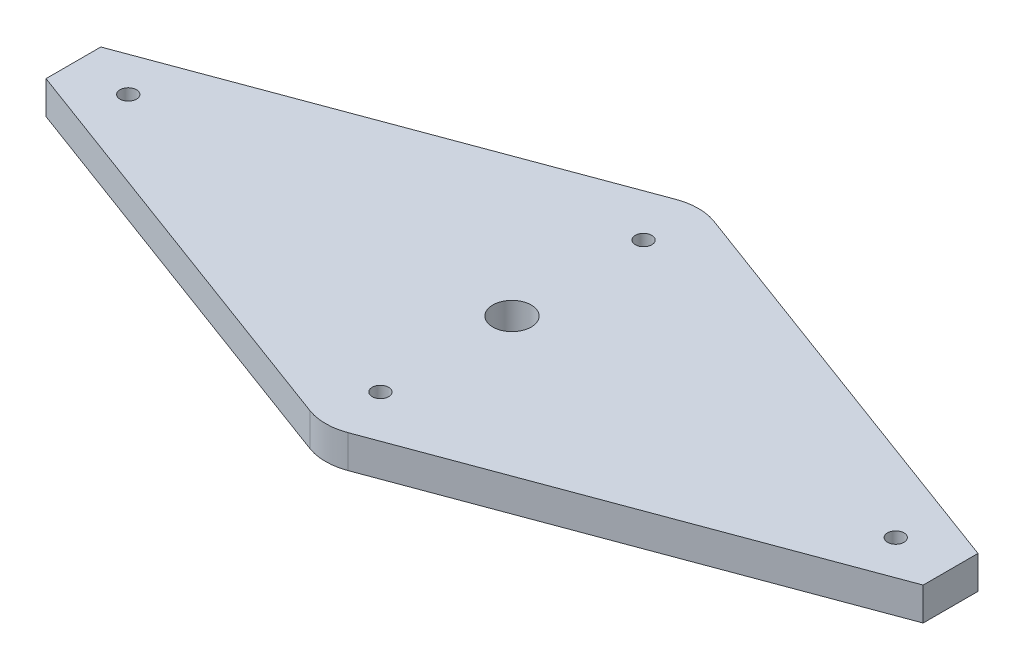
ISO-10303-21;
HEADER;
FILE_DESCRIPTION(('STEP AP214'),'2;1');
FILE_NAME('part.step','',(''),(''),'','','');
FILE_SCHEMA(('AUTOMOTIVE_DESIGN { 1 0 10303 214 1 1 1 1 }'));
ENDSEC;
DATA;
#1=APPLICATION_CONTEXT('core data for automotive mechanical design processes');
#2=APPLICATION_PROTOCOL_DEFINITION('international standard','automotive_design',2000,#1);
#3=PRODUCT_CONTEXT('',#1,'mechanical');
#4=PRODUCT('Part','Part','',(#3));
#5=PRODUCT_RELATED_PRODUCT_CATEGORY('part','',(#4));
#6=PRODUCT_DEFINITION_FORMATION('','',#4);
#7=PRODUCT_DEFINITION_CONTEXT('part definition',#1,'design');
#8=PRODUCT_DEFINITION('design','',#6,#7);
#9=PRODUCT_DEFINITION_SHAPE('','',#8);
#10=(LENGTH_UNIT() NAMED_UNIT(*) SI_UNIT(.MILLI.,.METRE.));
#11=(NAMED_UNIT(*) PLANE_ANGLE_UNIT() SI_UNIT($,.RADIAN.));
#12=(NAMED_UNIT(*) SI_UNIT($,.STERADIAN.) SOLID_ANGLE_UNIT());
#13=UNCERTAINTY_MEASURE_WITH_UNIT(LENGTH_MEASURE(1.E-05),#10,'distance_accuracy_value','');
#14=(GEOMETRIC_REPRESENTATION_CONTEXT(3) GLOBAL_UNCERTAINTY_ASSIGNED_CONTEXT((#13)) GLOBAL_UNIT_ASSIGNED_CONTEXT((#10,
#11,#12)) REPRESENTATION_CONTEXT('',''));
#15=CARTESIAN_POINT('',(0.,0.,0.));
#16=DIRECTION('',(0.,0.,1.));
#17=DIRECTION('',(1.,0.,0.));
#18=AXIS2_PLACEMENT_3D('',#15,#16,#17);
#19=CARTESIAN_POINT('',(0.,1.5,-12.));
#20=DIRECTION('',(0.,1.,0.));
#21=DIRECTION('',(0.,0.,1.));
#22=AXIS2_PLACEMENT_3D('',#19,#20,#21);
#23=PLANE('',#22);
#24=CARTESIAN_POINT('',(-35.,1.5,0.));
#25=DIRECTION('',(0.,1.,0.));
#26=DIRECTION('',(0.,0.,1.));
#27=AXIS2_PLACEMENT_3D('',#24,#25,#26);
#28=CIRCLE('',#27,0.749999999999999);
#29=CARTESIAN_POINT('',(-35.,1.5,0.749999999999999));
#30=VERTEX_POINT('',#29);
#31=EDGE_CURVE('E237',#30,#30,#28,.T.);
#32=ORIENTED_EDGE('',*,*,#31,.F.);
#33=EDGE_LOOP('',(#32));
#34=FACE_BOUND('',#33,.T.);
#35=CARTESIAN_POINT('',(0.,1.5,12.));
#36=DIRECTION('',(0.,1.,0.));
#37=DIRECTION('',(0.,0.,1.));
#38=AXIS2_PLACEMENT_3D('',#35,#36,#37);
#39=CIRCLE('',#38,0.750000000000001);
#40=CARTESIAN_POINT('',(0.,1.5,12.75));
#41=VERTEX_POINT('',#40);
#42=EDGE_CURVE('E249',#41,#41,#39,.T.);
#43=ORIENTED_EDGE('',*,*,#42,.F.);
#44=EDGE_LOOP('',(#43));
#45=FACE_BOUND('',#44,.T.);
#46=CARTESIAN_POINT('',(0.,1.5,-12.));
#47=DIRECTION('',(0.,1.,0.));
#48=DIRECTION('',(0.,0.,1.));
#49=AXIS2_PLACEMENT_3D('',#46,#47,#48);
#50=CIRCLE('',#49,5.);
#51=CARTESIAN_POINT('',(1.73841446724475,1.5,-16.6880609147146));
#52=VERTEX_POINT('',#51);
#53=CARTESIAN_POINT('',(-1.73841446724467,1.5,-16.6880609147146));
#54=VERTEX_POINT('',#53);
#55=EDGE_CURVE('E133',#52,#54,#50,.T.);
#56=ORIENTED_EDGE('',*,*,#55,.T.);
#57=DIRECTION('',(-0.937612182942912,0.,0.347682893448941));
#58=VECTOR('',#57,1.);
#59=CARTESIAN_POINT('',(-1.73841446724467,1.5,-16.6880609147146));
#60=LINE('',#59,#58);
#61=CARTESIAN_POINT('',(-40.,1.5,-2.50000000000001));
#62=VERTEX_POINT('',#61);
#63=EDGE_CURVE('E110',#54,#62,#60,.T.);
#64=ORIENTED_EDGE('',*,*,#63,.T.);
#65=DIRECTION('',(0.,0.,1.));
#66=VECTOR('',#65,1.);
#67=CARTESIAN_POINT('',(-40.,1.5,-2.50000000000001));
#68=LINE('',#67,#66);
#69=CARTESIAN_POINT('',(-40.,1.5,2.49999999999999));
#70=VERTEX_POINT('',#69);
#71=EDGE_CURVE('E136',#62,#70,#68,.T.);
#72=ORIENTED_EDGE('',*,*,#71,.T.);
#73=DIRECTION('',(0.937612182942911,0.,0.347682893448942));
#74=VECTOR('',#73,1.);
#75=CARTESIAN_POINT('',(-40.,1.5,2.49999999999999));
#76=LINE('',#75,#74);
#77=CARTESIAN_POINT('',(-1.73841446724474,1.5,16.6880609147146));
#78=VERTEX_POINT('',#77);
#79=EDGE_CURVE('E138',#70,#78,#76,.T.);
#80=ORIENTED_EDGE('',*,*,#79,.T.);
#81=CARTESIAN_POINT('',(0.,1.5,12.));
#82=DIRECTION('',(0.,1.,0.));
#83=DIRECTION('',(0.,0.,1.));
#84=AXIS2_PLACEMENT_3D('',#81,#82,#83);
#85=CIRCLE('',#84,5.);
#86=CARTESIAN_POINT('',(1.73841446724467,1.5,16.6880609147146));
#87=VERTEX_POINT('',#86);
#88=EDGE_CURVE('E140',#78,#87,#85,.T.);
#89=ORIENTED_EDGE('',*,*,#88,.T.);
#90=DIRECTION('',(0.937612182942912,0.,-0.347682893448941));
#91=VECTOR('',#90,1.);
#92=CARTESIAN_POINT('',(1.73841446724467,1.5,16.6880609147146));
#93=LINE('',#92,#91);
#94=CARTESIAN_POINT('',(40.,1.5,2.50000000000001));
#95=VERTEX_POINT('',#94);
#96=EDGE_CURVE('E142',#87,#95,#93,.T.);
#97=ORIENTED_EDGE('',*,*,#96,.T.);
#98=DIRECTION('',(0.,0.,-1.));
#99=VECTOR('',#98,1.);
#100=CARTESIAN_POINT('',(40.,1.5,2.50000000000001));
#101=LINE('',#100,#99);
#102=CARTESIAN_POINT('',(40.,1.5,-2.49999999999999));
#103=VERTEX_POINT('',#102);
#104=EDGE_CURVE('E51',#95,#103,#101,.T.);
#105=ORIENTED_EDGE('',*,*,#104,.T.);
#106=DIRECTION('',(-0.937612182942911,0.,-0.347682893448942));
#107=VECTOR('',#106,1.);
#108=CARTESIAN_POINT('',(40.,1.5,-2.49999999999999));
#109=LINE('',#108,#107);
#110=EDGE_CURVE('E46',#103,#52,#109,.T.);
#111=ORIENTED_EDGE('',*,*,#110,.T.);
#112=EDGE_LOOP('',(#56,#64,#72,#80,#89,#97,#105,#111));
#113=FACE_BOUND('',#112,.T.);
#114=CARTESIAN_POINT('',(0.,1.5,-12.));
#115=DIRECTION('',(0.,1.,0.));
#116=DIRECTION('',(0.,0.,1.));
#117=AXIS2_PLACEMENT_3D('',#114,#115,#116);
#118=CIRCLE('',#117,0.750000000000001);
#119=CARTESIAN_POINT('',(0.,1.5,-11.25));
#120=VERTEX_POINT('',#119);
#121=EDGE_CURVE('E115',#120,#120,#118,.T.);
#122=ORIENTED_EDGE('',*,*,#121,.F.);
#123=EDGE_LOOP('',(#122));
#124=FACE_BOUND('',#123,.T.);
#125=CARTESIAN_POINT('',(35.,1.5,0.));
#126=DIRECTION('',(0.,1.,0.));
#127=DIRECTION('',(0.,0.,1.));
#128=AXIS2_PLACEMENT_3D('',#125,#126,#127);
#129=CIRCLE('',#128,0.749999999999999);
#130=CARTESIAN_POINT('',(35.,1.5,0.749999999999999));
#131=VERTEX_POINT('',#130);
#132=EDGE_CURVE('E243',#131,#131,#129,.T.);
#133=ORIENTED_EDGE('',*,*,#132,.F.);
#134=EDGE_LOOP('',(#133));
#135=FACE_BOUND('',#134,.T.);
#136=CARTESIAN_POINT('',(0.,1.5,0.));
#137=DIRECTION('',(0.,1.,0.));
#138=DIRECTION('',(0.,0.,1.));
#139=AXIS2_PLACEMENT_3D('',#136,#137,#138);
#140=CIRCLE('',#139,1.75);
#141=CARTESIAN_POINT('',(0.,1.5,1.75));
#142=VERTEX_POINT('',#141);
#143=EDGE_CURVE('E226',#142,#142,#140,.T.);
#144=ORIENTED_EDGE('',*,*,#143,.F.);
#145=EDGE_LOOP('',(#144));
#146=FACE_BOUND('',#145,.T.);
#147=ADVANCED_FACE('F31',(#34,#45,#113,#124,#135,#146),#23,.T.);
#148=CARTESIAN_POINT('',(0.,-1.5,-12.));
#149=DIRECTION('',(0.,1.,0.));
#150=DIRECTION('',(0.,0.,1.));
#151=AXIS2_PLACEMENT_3D('',#148,#149,#150);
#152=PLANE('',#151);
#153=CARTESIAN_POINT('',(-35.,-1.5,0.));
#154=DIRECTION('',(0.,1.,0.));
#155=DIRECTION('',(0.,0.,1.));
#156=AXIS2_PLACEMENT_3D('',#153,#154,#155);
#157=CIRCLE('',#156,0.749999999999999);
#158=CARTESIAN_POINT('',(-35.,-1.5,0.749999999999999));
#159=VERTEX_POINT('',#158);
#160=EDGE_CURVE('E232',#159,#159,#157,.T.);
#161=ORIENTED_EDGE('',*,*,#160,.T.);
#162=EDGE_LOOP('',(#161));
#163=FACE_BOUND('',#162,.T.);
#164=CARTESIAN_POINT('',(0.,-1.5,12.));
#165=DIRECTION('',(0.,1.,0.));
#166=DIRECTION('',(0.,0.,1.));
#167=AXIS2_PLACEMENT_3D('',#164,#165,#166);
#168=CIRCLE('',#167,0.750000000000001);
#169=CARTESIAN_POINT('',(0.,-1.5,12.75));
#170=VERTEX_POINT('',#169);
#171=EDGE_CURVE('E246',#170,#170,#168,.T.);
#172=ORIENTED_EDGE('',*,*,#171,.T.);
#173=EDGE_LOOP('',(#172));
#174=FACE_BOUND('',#173,.T.);
#175=CARTESIAN_POINT('',(0.,-1.5,-12.));
#176=DIRECTION('',(0.,1.,0.));
#177=DIRECTION('',(0.,0.,1.));
#178=AXIS2_PLACEMENT_3D('',#175,#176,#177);
#179=CIRCLE('',#178,5.);
#180=CARTESIAN_POINT('',(1.73841446724475,-1.5,-16.6880609147146));
#181=VERTEX_POINT('',#180);
#182=CARTESIAN_POINT('',(-1.73841446724467,-1.5,-16.6880609147146));
#183=VERTEX_POINT('',#182);
#184=EDGE_CURVE('E101',#181,#183,#179,.T.);
#185=ORIENTED_EDGE('',*,*,#184,.F.);
#186=DIRECTION('',(-0.937612182942911,0.,-0.347682893448942));
#187=VECTOR('',#186,1.);
#188=CARTESIAN_POINT('',(40.,-1.5,-2.49999999999999));
#189=LINE('',#188,#187);
#190=CARTESIAN_POINT('',(40.,-1.5,-2.49999999999999));
#191=VERTEX_POINT('',#190);
#192=EDGE_CURVE('E131',#191,#181,#189,.T.);
#193=ORIENTED_EDGE('',*,*,#192,.F.);
#194=DIRECTION('',(0.,0.,-1.));
#195=VECTOR('',#194,1.);
#196=CARTESIAN_POINT('',(40.,-1.5,2.50000000000001));
#197=LINE('',#196,#195);
#198=CARTESIAN_POINT('',(40.,-1.5,2.50000000000001));
#199=VERTEX_POINT('',#198);
#200=EDGE_CURVE('E129',#199,#191,#197,.T.);
#201=ORIENTED_EDGE('',*,*,#200,.F.);
#202=DIRECTION('',(0.937612182942912,0.,-0.347682893448941));
#203=VECTOR('',#202,1.);
#204=CARTESIAN_POINT('',(1.73841446724467,-1.5,16.6880609147146));
#205=LINE('',#204,#203);
#206=CARTESIAN_POINT('',(1.73841446724467,-1.5,16.6880609147146));
#207=VERTEX_POINT('',#206);
#208=EDGE_CURVE('E127',#207,#199,#205,.T.);
#209=ORIENTED_EDGE('',*,*,#208,.F.);
#210=CARTESIAN_POINT('',(0.,-1.5,12.));
#211=DIRECTION('',(0.,1.,0.));
#212=DIRECTION('',(0.,0.,1.));
#213=AXIS2_PLACEMENT_3D('',#210,#211,#212);
#214=CIRCLE('',#213,5.);
#215=CARTESIAN_POINT('',(-1.73841446724474,-1.5,16.6880609147146));
#216=VERTEX_POINT('',#215);
#217=EDGE_CURVE('E125',#216,#207,#214,.T.);
#218=ORIENTED_EDGE('',*,*,#217,.F.);
#219=DIRECTION('',(0.937612182942911,0.,0.347682893448942));
#220=VECTOR('',#219,1.);
#221=CARTESIAN_POINT('',(-40.,-1.5,2.49999999999999));
#222=LINE('',#221,#220);
#223=CARTESIAN_POINT('',(-40.,-1.5,2.49999999999999));
#224=VERTEX_POINT('',#223);
#225=EDGE_CURVE('E123',#224,#216,#222,.T.);
#226=ORIENTED_EDGE('',*,*,#225,.F.);
#227=DIRECTION('',(0.,0.,1.));
#228=VECTOR('',#227,1.);
#229=CARTESIAN_POINT('',(-40.,-1.5,-2.50000000000001));
#230=LINE('',#229,#228);
#231=CARTESIAN_POINT('',(-40.,-1.5,-2.50000000000001));
#232=VERTEX_POINT('',#231);
#233=EDGE_CURVE('E103',#232,#224,#230,.T.);
#234=ORIENTED_EDGE('',*,*,#233,.F.);
#235=DIRECTION('',(-0.937612182942912,0.,0.347682893448941));
#236=VECTOR('',#235,1.);
#237=CARTESIAN_POINT('',(-1.73841446724467,-1.5,-16.6880609147146));
#238=LINE('',#237,#236);
#239=EDGE_CURVE('E96',#183,#232,#238,.T.);
#240=ORIENTED_EDGE('',*,*,#239,.F.);
#241=EDGE_LOOP('',(#185,#193,#201,#209,#218,#226,#234,#240));
#242=FACE_BOUND('',#241,.T.);
#243=CARTESIAN_POINT('',(0.,-1.5,-12.));
#244=DIRECTION('',(0.,1.,0.));
#245=DIRECTION('',(0.,0.,1.));
#246=AXIS2_PLACEMENT_3D('',#243,#244,#245);
#247=CIRCLE('',#246,0.750000000000001);
#248=CARTESIAN_POINT('',(0.,-1.5,-11.25));
#249=VERTEX_POINT('',#248);
#250=EDGE_CURVE('E118',#249,#249,#247,.T.);
#251=ORIENTED_EDGE('',*,*,#250,.T.);
#252=EDGE_LOOP('',(#251));
#253=FACE_BOUND('',#252,.T.);
#254=CARTESIAN_POINT('',(35.,-1.5,0.));
#255=DIRECTION('',(0.,1.,0.));
#256=DIRECTION('',(0.,0.,1.));
#257=AXIS2_PLACEMENT_3D('',#254,#255,#256);
#258=CIRCLE('',#257,0.749999999999999);
#259=CARTESIAN_POINT('',(35.,-1.5,0.749999999999999));
#260=VERTEX_POINT('',#259);
#261=EDGE_CURVE('E240',#260,#260,#258,.T.);
#262=ORIENTED_EDGE('',*,*,#261,.T.);
#263=EDGE_LOOP('',(#262));
#264=FACE_BOUND('',#263,.T.);
#265=CARTESIAN_POINT('',(0.,-1.5,0.));
#266=DIRECTION('',(0.,1.,0.));
#267=DIRECTION('',(0.,0.,1.));
#268=AXIS2_PLACEMENT_3D('',#265,#266,#267);
#269=CIRCLE('',#268,1.75);
#270=CARTESIAN_POINT('',(0.,-1.5,1.75));
#271=VERTEX_POINT('',#270);
#272=EDGE_CURVE('E229',#271,#271,#269,.T.);
#273=ORIENTED_EDGE('',*,*,#272,.T.);
#274=EDGE_LOOP('',(#273));
#275=FACE_BOUND('',#274,.T.);
#276=ADVANCED_FACE('F97',(#163,#174,#242,#253,#264,#275),#152,.F.);
#277=CARTESIAN_POINT('',(0.,1.5,-12.));
#278=DIRECTION('',(0.,-1.,0.));
#279=DIRECTION('',(0.,0.,-1.));
#280=AXIS2_PLACEMENT_3D('',#277,#278,#279);
#281=CYLINDRICAL_SURFACE('',#280,5.);
#282=ORIENTED_EDGE('',*,*,#184,.T.);
#283=DIRECTION('',(0.,-1.,0.));
#284=VECTOR('',#283,1.);
#285=CARTESIAN_POINT('',(-1.73841446724467,1.5,-16.6880609147146));
#286=LINE('',#285,#284);
#287=EDGE_CURVE('E11',#54,#183,#286,.T.);
#288=ORIENTED_EDGE('',*,*,#287,.F.);
#289=ORIENTED_EDGE('',*,*,#55,.F.);
#290=DIRECTION('',(0.,-1.,0.));
#291=VECTOR('',#290,1.);
#292=CARTESIAN_POINT('',(1.73841446724475,1.5,-16.6880609147146));
#293=LINE('',#292,#291);
#294=EDGE_CURVE('E114',#52,#181,#293,.T.);
#295=ORIENTED_EDGE('',*,*,#294,.T.);
#296=EDGE_LOOP('',(#282,#288,#289,#295));
#297=FACE_BOUND('',#296,.T.);
#298=ADVANCED_FACE('F33',(#297),#281,.T.);
#299=CARTESIAN_POINT('',(-1.73841446724467,1.5,-16.6880609147146));
#300=DIRECTION('',(0.347682893448941,0.,0.937612182942912));
#301=DIRECTION('',(0.937612182942912,0.,-0.347682893448941));
#302=AXIS2_PLACEMENT_3D('',#299,#300,#301);
#303=PLANE('',#302);
#304=ORIENTED_EDGE('',*,*,#239,.T.);
#305=DIRECTION('',(0.,-1.,0.));
#306=VECTOR('',#305,1.);
#307=CARTESIAN_POINT('',(-40.,1.5,-2.50000000000001));
#308=LINE('',#307,#306);
#309=EDGE_CURVE('E39',#62,#232,#308,.T.);
#310=ORIENTED_EDGE('',*,*,#309,.F.);
#311=ORIENTED_EDGE('',*,*,#63,.F.);
#312=ORIENTED_EDGE('',*,*,#287,.T.);
#313=EDGE_LOOP('',(#304,#310,#311,#312));
#314=FACE_BOUND('',#313,.T.);
#315=ADVANCED_FACE('F109',(#314),#303,.F.);
#316=CARTESIAN_POINT('',(-40.,1.5,-2.50000000000001));
#317=DIRECTION('',(1.,0.,0.));
#318=DIRECTION('',(0.,0.,-1.));
#319=AXIS2_PLACEMENT_3D('',#316,#317,#318);
#320=PLANE('',#319);
#321=ORIENTED_EDGE('',*,*,#233,.T.);
#322=DIRECTION('',(0.,-1.,0.));
#323=VECTOR('',#322,1.);
#324=CARTESIAN_POINT('',(-40.,1.5,2.49999999999999));
#325=LINE('',#324,#323);
#326=EDGE_CURVE('E159',#70,#224,#325,.T.);
#327=ORIENTED_EDGE('',*,*,#326,.F.);
#328=ORIENTED_EDGE('',*,*,#71,.F.);
#329=ORIENTED_EDGE('',*,*,#309,.T.);
#330=EDGE_LOOP('',(#321,#327,#328,#329));
#331=FACE_BOUND('',#330,.T.);
#332=ADVANCED_FACE('F163',(#331),#320,.F.);
#333=CARTESIAN_POINT('',(-40.,1.5,2.49999999999999));
#334=DIRECTION('',(0.347682893448942,0.,-0.937612182942911));
#335=DIRECTION('',(-0.937612182942912,0.,-0.347682893448942));
#336=AXIS2_PLACEMENT_3D('',#333,#334,#335);
#337=PLANE('',#336);
#338=ORIENTED_EDGE('',*,*,#225,.T.);
#339=DIRECTION('',(0.,-1.,0.));
#340=VECTOR('',#339,1.);
#341=CARTESIAN_POINT('',(-1.73841446724474,1.5,16.6880609147146));
#342=LINE('',#341,#340);
#343=EDGE_CURVE('E156',#78,#216,#342,.T.);
#344=ORIENTED_EDGE('',*,*,#343,.F.);
#345=ORIENTED_EDGE('',*,*,#79,.F.);
#346=ORIENTED_EDGE('',*,*,#326,.T.);
#347=EDGE_LOOP('',(#338,#344,#345,#346));
#348=FACE_BOUND('',#347,.T.);
#349=ADVANCED_FACE('F171',(#348),#337,.F.);
#350=CARTESIAN_POINT('',(0.,1.5,12.));
#351=DIRECTION('',(0.,-1.,0.));
#352=DIRECTION('',(0.,0.,-1.));
#353=AXIS2_PLACEMENT_3D('',#350,#351,#352);
#354=CYLINDRICAL_SURFACE('',#353,5.);
#355=ORIENTED_EDGE('',*,*,#217,.T.);
#356=DIRECTION('',(0.,-1.,0.));
#357=VECTOR('',#356,1.);
#358=CARTESIAN_POINT('',(1.73841446724467,1.5,16.6880609147146));
#359=LINE('',#358,#357);
#360=EDGE_CURVE('E153',#87,#207,#359,.T.);
#361=ORIENTED_EDGE('',*,*,#360,.F.);
#362=ORIENTED_EDGE('',*,*,#88,.F.);
#363=ORIENTED_EDGE('',*,*,#343,.T.);
#364=EDGE_LOOP('',(#355,#361,#362,#363));
#365=FACE_BOUND('',#364,.T.);
#366=ADVANCED_FACE('F174',(#365),#354,.T.);
#367=CARTESIAN_POINT('',(1.73841446724467,1.5,16.6880609147146));
#368=DIRECTION('',(-0.347682893448941,0.,-0.937612182942912));
#369=DIRECTION('',(-0.937612182942912,0.,0.347682893448941));
#370=AXIS2_PLACEMENT_3D('',#367,#368,#369);
#371=PLANE('',#370);
#372=ORIENTED_EDGE('',*,*,#208,.T.);
#373=DIRECTION('',(0.,-1.,0.));
#374=VECTOR('',#373,1.);
#375=CARTESIAN_POINT('',(40.,1.5,2.50000000000001));
#376=LINE('',#375,#374);
#377=EDGE_CURVE('E150',#95,#199,#376,.T.);
#378=ORIENTED_EDGE('',*,*,#377,.F.);
#379=ORIENTED_EDGE('',*,*,#96,.F.);
#380=ORIENTED_EDGE('',*,*,#360,.T.);
#381=EDGE_LOOP('',(#372,#378,#379,#380));
#382=FACE_BOUND('',#381,.T.);
#383=ADVANCED_FACE('F179',(#382),#371,.F.);
#384=CARTESIAN_POINT('',(40.,1.5,2.50000000000001));
#385=DIRECTION('',(-1.,0.,0.));
#386=DIRECTION('',(0.,0.,1.));
#387=AXIS2_PLACEMENT_3D('',#384,#385,#386);
#388=PLANE('',#387);
#389=ORIENTED_EDGE('',*,*,#200,.T.);
#390=DIRECTION('',(0.,-1.,0.));
#391=VECTOR('',#390,1.);
#392=CARTESIAN_POINT('',(40.,1.5,-2.49999999999999));
#393=LINE('',#392,#391);
#394=EDGE_CURVE('E147',#103,#191,#393,.T.);
#395=ORIENTED_EDGE('',*,*,#394,.F.);
#396=ORIENTED_EDGE('',*,*,#104,.F.);
#397=ORIENTED_EDGE('',*,*,#377,.T.);
#398=EDGE_LOOP('',(#389,#395,#396,#397));
#399=FACE_BOUND('',#398,.T.);
#400=ADVANCED_FACE('F182',(#399),#388,.F.);
#401=CARTESIAN_POINT('',(40.,1.5,-2.49999999999999));
#402=DIRECTION('',(-0.347682893448942,0.,0.937612182942911));
#403=DIRECTION('',(0.937612182942912,0.,0.347682893448942));
#404=AXIS2_PLACEMENT_3D('',#401,#402,#403);
#405=PLANE('',#404);
#406=ORIENTED_EDGE('',*,*,#192,.T.);
#407=ORIENTED_EDGE('',*,*,#294,.F.);
#408=ORIENTED_EDGE('',*,*,#110,.F.);
#409=ORIENTED_EDGE('',*,*,#394,.T.);
#410=EDGE_LOOP('',(#406,#407,#408,#409));
#411=FACE_BOUND('',#410,.T.);
#412=ADVANCED_FACE('F184',(#411),#405,.F.);
#413=CARTESIAN_POINT('',(0.,1.5,-12.));
#414=DIRECTION('',(0.,-1.,0.));
#415=DIRECTION('',(0.,0.,-1.));
#416=AXIS2_PLACEMENT_3D('',#413,#414,#415);
#417=CYLINDRICAL_SURFACE('',#416,0.750000000000001);
#418=ORIENTED_EDGE('',*,*,#121,.T.);
#419=EDGE_LOOP('',(#418));
#420=FACE_BOUND('',#419,.T.);
#421=ORIENTED_EDGE('',*,*,#250,.F.);
#422=EDGE_LOOP('',(#421));
#423=FACE_BOUND('',#422,.T.);
#424=ADVANCED_FACE('F186',(#420,#423),#417,.F.);
#425=CARTESIAN_POINT('',(0.,1.5,12.));
#426=DIRECTION('',(0.,-1.,0.));
#427=DIRECTION('',(0.,0.,-1.));
#428=AXIS2_PLACEMENT_3D('',#425,#426,#427);
#429=CYLINDRICAL_SURFACE('',#428,0.750000000000001);
#430=ORIENTED_EDGE('',*,*,#42,.T.);
#431=EDGE_LOOP('',(#430));
#432=FACE_BOUND('',#431,.T.);
#433=ORIENTED_EDGE('',*,*,#171,.F.);
#434=EDGE_LOOP('',(#433));
#435=FACE_BOUND('',#434,.T.);
#436=ADVANCED_FACE('F192',(#432,#435),#429,.F.);
#437=CARTESIAN_POINT('',(35.,1.5,0.));
#438=DIRECTION('',(0.,-1.,0.));
#439=DIRECTION('',(0.,0.,-1.));
#440=AXIS2_PLACEMENT_3D('',#437,#438,#439);
#441=CYLINDRICAL_SURFACE('',#440,0.749999999999999);
#442=ORIENTED_EDGE('',*,*,#132,.T.);
#443=EDGE_LOOP('',(#442));
#444=FACE_BOUND('',#443,.T.);
#445=ORIENTED_EDGE('',*,*,#261,.F.);
#446=EDGE_LOOP('',(#445));
#447=FACE_BOUND('',#446,.T.);
#448=ADVANCED_FACE('F209',(#444,#447),#441,.F.);
#449=CARTESIAN_POINT('',(-35.,1.5,0.));
#450=DIRECTION('',(0.,-1.,0.));
#451=DIRECTION('',(0.,0.,-1.));
#452=AXIS2_PLACEMENT_3D('',#449,#450,#451);
#453=CYLINDRICAL_SURFACE('',#452,0.749999999999999);
#454=ORIENTED_EDGE('',*,*,#31,.T.);
#455=EDGE_LOOP('',(#454));
#456=FACE_BOUND('',#455,.T.);
#457=ORIENTED_EDGE('',*,*,#160,.F.);
#458=EDGE_LOOP('',(#457));
#459=FACE_BOUND('',#458,.T.);
#460=ADVANCED_FACE('F213',(#456,#459),#453,.F.);
#461=CARTESIAN_POINT('',(0.,1.5,0.));
#462=DIRECTION('',(0.,-1.,0.));
#463=DIRECTION('',(0.,0.,-1.));
#464=AXIS2_PLACEMENT_3D('',#461,#462,#463);
#465=CYLINDRICAL_SURFACE('',#464,1.75);
#466=ORIENTED_EDGE('',*,*,#143,.T.);
#467=EDGE_LOOP('',(#466));
#468=FACE_BOUND('',#467,.T.);
#469=ORIENTED_EDGE('',*,*,#272,.F.);
#470=EDGE_LOOP('',(#469));
#471=FACE_BOUND('',#470,.T.);
#472=ADVANCED_FACE('F217',(#468,#471),#465,.F.);
#473=CLOSED_SHELL('',(#147,#276,#298,#315,#332,#349,#366,#383,#400,#412,#424,#436,#448,#460,#472));
#474=MANIFOLD_SOLID_BREP('B2',#473);
#475=ADVANCED_BREP_SHAPE_REPRESENTATION('',(#18,#474),#14);
#476=SHAPE_DEFINITION_REPRESENTATION(#9,#475);
ENDSEC;
END-ISO-10303-21;
